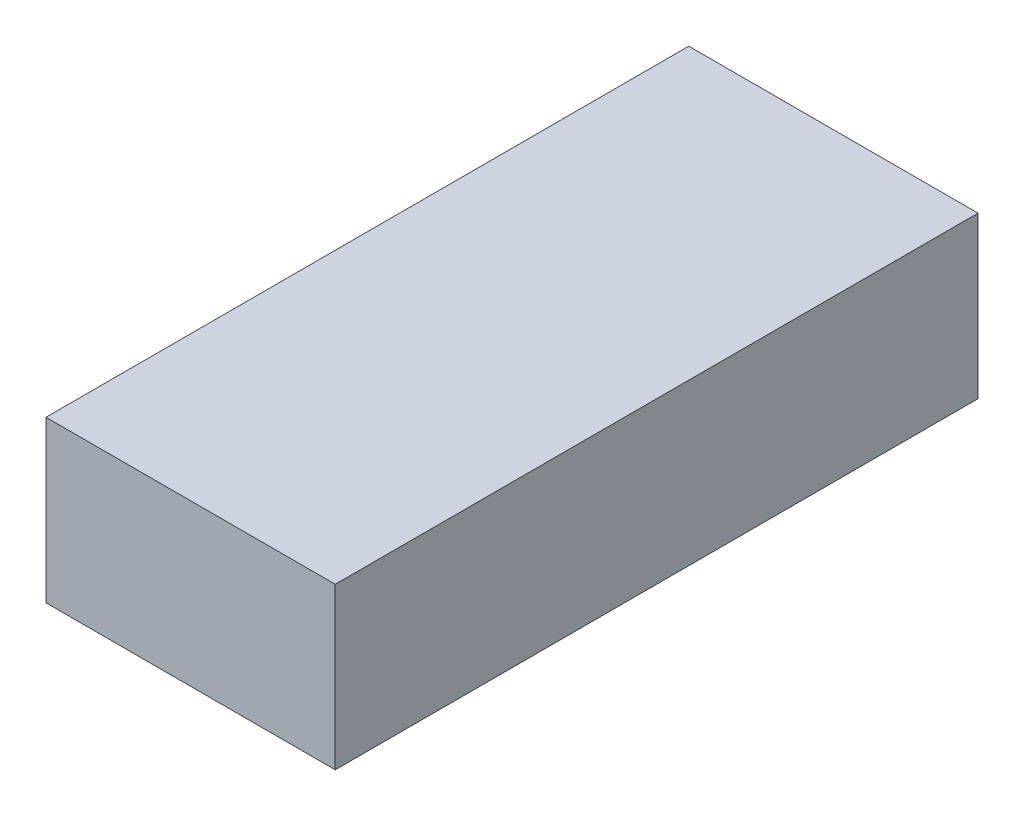
ISO-10303-21;
HEADER;
FILE_DESCRIPTION(('STEP AP214'),'2;1');
FILE_NAME('part.step','',(''),(''),'','','');
FILE_SCHEMA(('AUTOMOTIVE_DESIGN { 1 0 10303 214 1 1 1 1 }'));
ENDSEC;
DATA;
#1=APPLICATION_CONTEXT('core data for automotive mechanical design processes');
#2=APPLICATION_PROTOCOL_DEFINITION('international standard','automotive_design',2000,#1);
#3=PRODUCT_CONTEXT('',#1,'mechanical');
#4=PRODUCT('Part','Part','',(#3));
#5=PRODUCT_RELATED_PRODUCT_CATEGORY('part','',(#4));
#6=PRODUCT_DEFINITION_FORMATION('','',#4);
#7=PRODUCT_DEFINITION_CONTEXT('part definition',#1,'design');
#8=PRODUCT_DEFINITION('design','',#6,#7);
#9=PRODUCT_DEFINITION_SHAPE('','',#8);
#10=(LENGTH_UNIT() NAMED_UNIT(*) SI_UNIT(.MILLI.,.METRE.));
#11=(NAMED_UNIT(*) PLANE_ANGLE_UNIT() SI_UNIT($,.RADIAN.));
#12=(NAMED_UNIT(*) SI_UNIT($,.STERADIAN.) SOLID_ANGLE_UNIT());
#13=UNCERTAINTY_MEASURE_WITH_UNIT(LENGTH_MEASURE(1.E-05),#10,'distance_accuracy_value','');
#14=(GEOMETRIC_REPRESENTATION_CONTEXT(3) GLOBAL_UNCERTAINTY_ASSIGNED_CONTEXT((#13)) GLOBAL_UNIT_ASSIGNED_CONTEXT((#10,
#11,#12)) REPRESENTATION_CONTEXT('',''));
#15=CARTESIAN_POINT('',(0.,0.,0.));
#16=DIRECTION('',(0.,0.,1.));
#17=DIRECTION('',(1.,0.,0.));
#18=AXIS2_PLACEMENT_3D('',#15,#16,#17);
#19=CARTESIAN_POINT('',(0.,2.5,0.));
#20=DIRECTION('',(0.,0.,-1.));
#21=DIRECTION('',(-1.,0.,0.));
#22=AXIS2_PLACEMENT_3D('',#19,#20,#21);
#23=PLANE('',#22);
#24=DIRECTION('',(1.,0.,0.));
#25=VECTOR('',#24,1.);
#26=CARTESIAN_POINT('',(0.,0.,0.));
#27=LINE('',#26,#25);
#28=CARTESIAN_POINT('',(0.,0.,0.));
#29=VERTEX_POINT('',#28);
#30=CARTESIAN_POINT('',(4.5,0.,0.));
#31=VERTEX_POINT('',#30);
#32=EDGE_CURVE('E96',#29,#31,#27,.T.);
#33=ORIENTED_EDGE('',*,*,#32,.T.);
#34=DIRECTION('',(0.,-1.,0.));
#35=VECTOR('',#34,1.);
#36=CARTESIAN_POINT('',(4.5,2.5,0.));
#37=LINE('',#36,#35);
#38=CARTESIAN_POINT('',(4.5,2.5,0.));
#39=VERTEX_POINT('',#38);
#40=EDGE_CURVE('E11',#39,#31,#37,.T.);
#41=ORIENTED_EDGE('',*,*,#40,.F.);
#42=DIRECTION('',(1.,0.,0.));
#43=VECTOR('',#42,1.);
#44=CARTESIAN_POINT('',(0.,2.5,0.));
#45=LINE('',#44,#43);
#46=CARTESIAN_POINT('',(0.,2.5,0.));
#47=VERTEX_POINT('',#46);
#48=EDGE_CURVE('E82',#47,#39,#45,.T.);
#49=ORIENTED_EDGE('',*,*,#48,.F.);
#50=DIRECTION('',(0.,-1.,0.));
#51=VECTOR('',#50,1.);
#52=CARTESIAN_POINT('',(0.,2.5,0.));
#53=LINE('',#52,#51);
#54=EDGE_CURVE('E49',#47,#29,#53,.T.);
#55=ORIENTED_EDGE('',*,*,#54,.T.);
#56=EDGE_LOOP('',(#33,#41,#49,#55));
#57=FACE_BOUND('',#56,.T.);
#58=ADVANCED_FACE('F33',(#57),#23,.F.);
#59=CARTESIAN_POINT('',(4.5,2.5,0.));
#60=DIRECTION('',(-1.,0.,0.));
#61=DIRECTION('',(0.,0.,1.));
#62=AXIS2_PLACEMENT_3D('',#59,#60,#61);
#63=PLANE('',#62);
#64=DIRECTION('',(0.,0.,-1.));
#65=VECTOR('',#64,1.);
#66=CARTESIAN_POINT('',(4.5,0.,0.));
#67=LINE('',#66,#65);
#68=CARTESIAN_POINT('',(4.5,0.,-10.));
#69=VERTEX_POINT('',#68);
#70=EDGE_CURVE('E87',#31,#69,#67,.T.);
#71=ORIENTED_EDGE('',*,*,#70,.T.);
#72=DIRECTION('',(0.,-1.,0.));
#73=VECTOR('',#72,1.);
#74=CARTESIAN_POINT('',(4.5,2.5,-10.));
#75=LINE('',#74,#73);
#76=CARTESIAN_POINT('',(4.5,2.5,-10.));
#77=VERTEX_POINT('',#76);
#78=EDGE_CURVE('E41',#77,#69,#75,.T.);
#79=ORIENTED_EDGE('',*,*,#78,.F.);
#80=DIRECTION('',(0.,0.,-1.));
#81=VECTOR('',#80,1.);
#82=CARTESIAN_POINT('',(4.5,2.5,0.));
#83=LINE('',#82,#81);
#84=EDGE_CURVE('E74',#39,#77,#83,.T.);
#85=ORIENTED_EDGE('',*,*,#84,.F.);
#86=ORIENTED_EDGE('',*,*,#40,.T.);
#87=EDGE_LOOP('',(#71,#79,#85,#86));
#88=FACE_BOUND('',#87,.T.);
#89=ADVANCED_FACE('F86',(#88),#63,.F.);
#90=CARTESIAN_POINT('',(0.,2.5,-10.));
#91=DIRECTION('',(0.,0.,-1.));
#92=DIRECTION('',(-1.,0.,0.));
#93=AXIS2_PLACEMENT_3D('',#90,#91,#92);
#94=PLANE('',#93);
#95=DIRECTION('',(1.,0.,0.));
#96=VECTOR('',#95,1.);
#97=CARTESIAN_POINT('',(0.,0.,-10.));
#98=LINE('',#97,#96);
#99=CARTESIAN_POINT('',(0.,0.,-10.));
#100=VERTEX_POINT('',#99);
#101=EDGE_CURVE('E99',#100,#69,#98,.T.);
#102=ORIENTED_EDGE('',*,*,#101,.F.);
#103=DIRECTION('',(0.,-1.,0.));
#104=VECTOR('',#103,1.);
#105=CARTESIAN_POINT('',(0.,2.5,-10.));
#106=LINE('',#105,#104);
#107=CARTESIAN_POINT('',(0.,2.5,-10.));
#108=VERTEX_POINT('',#107);
#109=EDGE_CURVE('E63',#108,#100,#106,.T.);
#110=ORIENTED_EDGE('',*,*,#109,.F.);
#111=DIRECTION('',(1.,0.,0.));
#112=VECTOR('',#111,1.);
#113=CARTESIAN_POINT('',(0.,2.5,-10.));
#114=LINE('',#113,#112);
#115=EDGE_CURVE('E81',#108,#77,#114,.T.);
#116=ORIENTED_EDGE('',*,*,#115,.T.);
#117=ORIENTED_EDGE('',*,*,#78,.T.);
#118=EDGE_LOOP('',(#102,#110,#116,#117));
#119=FACE_BOUND('',#118,.T.);
#120=ADVANCED_FACE('F90',(#119),#94,.T.);
#121=CARTESIAN_POINT('',(0.,2.5,0.));
#122=DIRECTION('',(-1.,0.,0.));
#123=DIRECTION('',(0.,0.,1.));
#124=AXIS2_PLACEMENT_3D('',#121,#122,#123);
#125=PLANE('',#124);
#126=DIRECTION('',(0.,0.,-1.));
#127=VECTOR('',#126,1.);
#128=CARTESIAN_POINT('',(0.,0.,0.));
#129=LINE('',#128,#127);
#130=EDGE_CURVE('E101',#29,#100,#129,.T.);
#131=ORIENTED_EDGE('',*,*,#130,.F.);
#132=ORIENTED_EDGE('',*,*,#54,.F.);
#133=DIRECTION('',(0.,0.,-1.));
#134=VECTOR('',#133,1.);
#135=CARTESIAN_POINT('',(0.,2.5,0.));
#136=LINE('',#135,#134);
#137=EDGE_CURVE('E91',#47,#108,#136,.T.);
#138=ORIENTED_EDGE('',*,*,#137,.T.);
#139=ORIENTED_EDGE('',*,*,#109,.T.);
#140=EDGE_LOOP('',(#131,#132,#138,#139));
#141=FACE_BOUND('',#140,.T.);
#142=ADVANCED_FACE('F107',(#141),#125,.T.);
#143=CARTESIAN_POINT('',(0.,2.5,0.));
#144=DIRECTION('',(0.,1.,0.));
#145=DIRECTION('',(0.,0.,1.));
#146=AXIS2_PLACEMENT_3D('',#143,#144,#145);
#147=PLANE('',#146);
#148=ORIENTED_EDGE('',*,*,#48,.T.);
#149=ORIENTED_EDGE('',*,*,#84,.T.);
#150=ORIENTED_EDGE('',*,*,#115,.F.);
#151=ORIENTED_EDGE('',*,*,#137,.F.);
#152=EDGE_LOOP('',(#148,#149,#150,#151));
#153=FACE_BOUND('',#152,.T.);
#154=ADVANCED_FACE('F78',(#153),#147,.T.);
#155=CARTESIAN_POINT('',(0.,0.,0.));
#156=DIRECTION('',(0.,1.,0.));
#157=DIRECTION('',(0.,0.,1.));
#158=AXIS2_PLACEMENT_3D('',#155,#156,#157);
#159=PLANE('',#158);
#160=ORIENTED_EDGE('',*,*,#32,.F.);
#161=ORIENTED_EDGE('',*,*,#130,.T.);
#162=ORIENTED_EDGE('',*,*,#101,.T.);
#163=ORIENTED_EDGE('',*,*,#70,.F.);
#164=EDGE_LOOP('',(#160,#161,#162,#163));
#165=FACE_BOUND('',#164,.T.);
#166=ADVANCED_FACE('F106',(#165),#159,.F.);
#167=CLOSED_SHELL('',(#58,#89,#120,#142,#154,#166));
#168=MANIFOLD_SOLID_BREP('B2',#167);
#169=ADVANCED_BREP_SHAPE_REPRESENTATION('',(#18,#168),#14);
#170=SHAPE_DEFINITION_REPRESENTATION(#9,#169);
ENDSEC;
END-ISO-10303-21;
